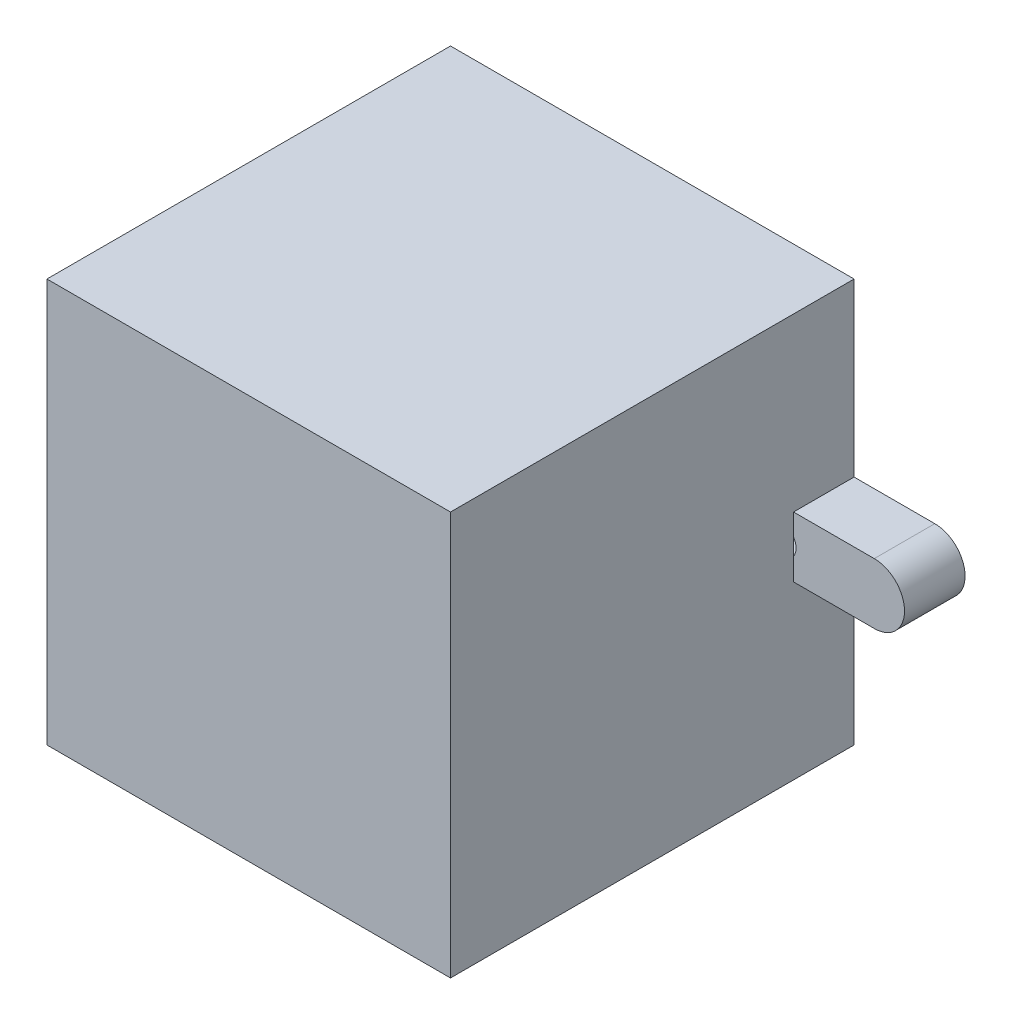
ISO-10303-21;
HEADER;
FILE_DESCRIPTION(('STEP AP214'),'2;1');
FILE_NAME('part.step','',(''),(''),'','','');
FILE_SCHEMA(('AUTOMOTIVE_DESIGN { 1 0 10303 214 1 1 1 1 }'));
ENDSEC;
DATA;
#1=APPLICATION_CONTEXT('core data for automotive mechanical design processes');
#2=APPLICATION_PROTOCOL_DEFINITION('international standard','automotive_design',2000,#1);
#3=PRODUCT_CONTEXT('',#1,'mechanical');
#4=PRODUCT('Part','Part','',(#3));
#5=PRODUCT_RELATED_PRODUCT_CATEGORY('part','',(#4));
#6=PRODUCT_DEFINITION_FORMATION('','',#4);
#7=PRODUCT_DEFINITION_CONTEXT('part definition',#1,'design');
#8=PRODUCT_DEFINITION('design','',#6,#7);
#9=PRODUCT_DEFINITION_SHAPE('','',#8);
#10=(LENGTH_UNIT() NAMED_UNIT(*) SI_UNIT(.MILLI.,.METRE.));
#11=(NAMED_UNIT(*) PLANE_ANGLE_UNIT() SI_UNIT($,.RADIAN.));
#12=(NAMED_UNIT(*) SI_UNIT($,.STERADIAN.) SOLID_ANGLE_UNIT());
#13=UNCERTAINTY_MEASURE_WITH_UNIT(LENGTH_MEASURE(1.E-05),#10,'distance_accuracy_value','');
#14=(GEOMETRIC_REPRESENTATION_CONTEXT(3) GLOBAL_UNCERTAINTY_ASSIGNED_CONTEXT((#13)) GLOBAL_UNIT_ASSIGNED_CONTEXT((#10,
#11,#12)) REPRESENTATION_CONTEXT('',''));
#15=CARTESIAN_POINT('',(0.,0.,0.));
#16=DIRECTION('',(0.,0.,1.));
#17=DIRECTION('',(1.,0.,0.));
#18=AXIS2_PLACEMENT_3D('',#15,#16,#17);
#19=CARTESIAN_POINT('',(-22.,-0.0526670776595875,4.));
#20=DIRECTION('',(0.,0.,-1.));
#21=DIRECTION('',(-1.,0.,0.));
#22=AXIS2_PLACEMENT_3D('',#19,#20,#21);
#23=CYLINDRICAL_SURFACE('',#22,2.);
#24=DIRECTION('',(0.,0.,1.));
#25=VECTOR('',#24,1.);
#26=CARTESIAN_POINT('',(-22.,1.94733292234041,4.));
#27=LINE('',#26,#25);
#28=CARTESIAN_POINT('',(-22.,1.94733292234041,4.));
#29=VERTEX_POINT('',#28);
#30=CARTESIAN_POINT('',(-22.,1.94733292234041,0.));
#31=VERTEX_POINT('',#30);
#32=EDGE_CURVE('E348',#29,#31,#27,.F.);
#33=ORIENTED_EDGE('',*,*,#32,.F.);
#34=CARTESIAN_POINT('',(-22.,-0.0526670776595875,4.));
#35=DIRECTION('',(0.,0.,-1.));
#36=DIRECTION('',(-1.,0.,0.));
#37=AXIS2_PLACEMENT_3D('',#34,#35,#36);
#38=CIRCLE('',#37,2.);
#39=CARTESIAN_POINT('',(-22.,-2.05266707765959,4.));
#40=VERTEX_POINT('',#39);
#41=EDGE_CURVE('E51',#40,#29,#38,.T.);
#42=ORIENTED_EDGE('',*,*,#41,.F.);
#43=DIRECTION('',(0.,0.,1.));
#44=VECTOR('',#43,1.);
#45=CARTESIAN_POINT('',(-22.,-2.05266707765959,4.));
#46=LINE('',#45,#44);
#47=CARTESIAN_POINT('',(-22.,-2.05266707765959,0.));
#48=VERTEX_POINT('',#47);
#49=EDGE_CURVE('E351',#48,#40,#46,.T.);
#50=ORIENTED_EDGE('',*,*,#49,.F.);
#51=CARTESIAN_POINT('',(-22.,-0.0526670776595875,0.));
#52=DIRECTION('',(0.,0.,1.));
#53=DIRECTION('',(1.,0.,0.));
#54=AXIS2_PLACEMENT_3D('',#51,#52,#53);
#55=CIRCLE('',#54,2.);
#56=EDGE_CURVE('E11',#48,#31,#55,.F.);
#57=ORIENTED_EDGE('',*,*,#56,.T.);
#58=EDGE_LOOP('',(#33,#42,#50,#57));
#59=FACE_BOUND('',#58,.T.);
#60=ADVANCED_FACE('F43',(#59),#23,.F.);
#61=CARTESIAN_POINT('',(-28.,0.,0.));
#62=DIRECTION('',(0.,0.,-1.));
#63=DIRECTION('',(-1.,0.,0.));
#64=AXIS2_PLACEMENT_3D('',#61,#62,#63);
#65=CYLINDRICAL_SURFACE('',#64,3.);
#66=DIRECTION('',(0.,0.,-1.));
#67=VECTOR('',#66,1.);
#68=CARTESIAN_POINT('',(-28.,3.,6.00000000000001));
#69=LINE('',#68,#67);
#70=CARTESIAN_POINT('',(-28.,3.,0.));
#71=VERTEX_POINT('',#70);
#72=CARTESIAN_POINT('',(-28.,3.,6.00000000000001));
#73=VERTEX_POINT('',#72);
#74=EDGE_CURVE('E338',#71,#73,#69,.F.);
#75=ORIENTED_EDGE('',*,*,#74,.F.);
#76=CARTESIAN_POINT('',(-28.,0.,0.));
#77=DIRECTION('',(0.,0.,1.));
#78=DIRECTION('',(1.,0.,0.));
#79=AXIS2_PLACEMENT_3D('',#76,#77,#78);
#80=CIRCLE('',#79,3.);
#81=CARTESIAN_POINT('',(-28.,-3.,0.));
#82=VERTEX_POINT('',#81);
#83=EDGE_CURVE('E344',#82,#71,#80,.F.);
#84=ORIENTED_EDGE('',*,*,#83,.F.);
#85=DIRECTION('',(0.,0.,-1.));
#86=VECTOR('',#85,1.);
#87=CARTESIAN_POINT('',(-28.,-3.,6.00000000000001));
#88=LINE('',#87,#86);
#89=CARTESIAN_POINT('',(-28.,-3.,6.00000000000001));
#90=VERTEX_POINT('',#89);
#91=EDGE_CURVE('E341',#90,#82,#88,.T.);
#92=ORIENTED_EDGE('',*,*,#91,.F.);
#93=CARTESIAN_POINT('',(-28.,0.,6.00000000000001));
#94=DIRECTION('',(0.,0.,-1.));
#95=DIRECTION('',(-1.,0.,0.));
#96=AXIS2_PLACEMENT_3D('',#93,#94,#95);
#97=CIRCLE('',#96,3.);
#98=EDGE_CURVE('E346',#73,#90,#97,.F.);
#99=ORIENTED_EDGE('',*,*,#98,.F.);
#100=EDGE_LOOP('',(#75,#84,#92,#99));
#101=FACE_BOUND('',#100,.T.);
#102=ADVANCED_FACE('F468',(#101),#65,.T.);
#103=CARTESIAN_POINT('',(22.,0.0294396054467806,0.));
#104=DIRECTION('',(0.,0.,-1.));
#105=DIRECTION('',(-1.,0.,0.));
#106=AXIS2_PLACEMENT_3D('',#103,#104,#105);
#107=CYLINDRICAL_SURFACE('',#106,2.);
#108=DIRECTION('',(0.,0.,1.));
#109=VECTOR('',#108,1.);
#110=CARTESIAN_POINT('',(22.,2.02943960544678,0.));
#111=LINE('',#110,#109);
#112=CARTESIAN_POINT('',(22.,2.02943960544678,0.));
#113=VERTEX_POINT('',#112);
#114=CARTESIAN_POINT('',(22.,2.02943960544678,4.));
#115=VERTEX_POINT('',#114);
#116=EDGE_CURVE('E328',#113,#115,#111,.T.);
#117=ORIENTED_EDGE('',*,*,#116,.F.);
#118=CARTESIAN_POINT('',(22.,0.0294396054467806,0.));
#119=DIRECTION('',(0.,0.,1.));
#120=DIRECTION('',(1.,0.,0.));
#121=AXIS2_PLACEMENT_3D('',#118,#119,#120);
#122=CIRCLE('',#121,2.);
#123=CARTESIAN_POINT('',(22.,-1.97056039455322,0.));
#124=VERTEX_POINT('',#123);
#125=EDGE_CURVE('E336',#113,#124,#122,.F.);
#126=ORIENTED_EDGE('',*,*,#125,.T.);
#127=DIRECTION('',(0.,0.,1.));
#128=VECTOR('',#127,1.);
#129=CARTESIAN_POINT('',(22.,-1.97056039455322,0.));
#130=LINE('',#129,#128);
#131=CARTESIAN_POINT('',(22.,-1.97056039455322,4.));
#132=VERTEX_POINT('',#131);
#133=EDGE_CURVE('E331',#132,#124,#130,.F.);
#134=ORIENTED_EDGE('',*,*,#133,.F.);
#135=CARTESIAN_POINT('',(22.,0.0294396054467806,4.));
#136=DIRECTION('',(0.,0.,1.));
#137=DIRECTION('',(1.,0.,0.));
#138=AXIS2_PLACEMENT_3D('',#135,#136,#137);
#139=CIRCLE('',#138,2.);
#140=EDGE_CURVE('E334',#115,#132,#139,.F.);
#141=ORIENTED_EDGE('',*,*,#140,.F.);
#142=EDGE_LOOP('',(#117,#126,#134,#141));
#143=FACE_BOUND('',#142,.T.);
#144=ADVANCED_FACE('F473',(#143),#107,.F.);
#145=CARTESIAN_POINT('',(28.,0.,6.00000000000001));
#146=DIRECTION('',(0.,0.,-1.));
#147=DIRECTION('',(-1.,0.,0.));
#148=AXIS2_PLACEMENT_3D('',#145,#146,#147);
#149=CYLINDRICAL_SURFACE('',#148,3.);
#150=DIRECTION('',(0.,0.,-1.));
#151=VECTOR('',#150,1.);
#152=CARTESIAN_POINT('',(28.,3.,6.00000000000001));
#153=LINE('',#152,#151);
#154=CARTESIAN_POINT('',(28.,3.,6.00000000000001));
#155=VERTEX_POINT('',#154);
#156=CARTESIAN_POINT('',(28.,3.,0.));
#157=VERTEX_POINT('',#156);
#158=EDGE_CURVE('E315',#155,#157,#153,.T.);
#159=ORIENTED_EDGE('',*,*,#158,.F.);
#160=CARTESIAN_POINT('',(28.,0.,6.00000000000001));
#161=DIRECTION('',(0.,0.,1.));
#162=DIRECTION('',(1.,0.,0.));
#163=AXIS2_PLACEMENT_3D('',#160,#161,#162);
#164=CIRCLE('',#163,3.);
#165=CARTESIAN_POINT('',(28.,-3.,6.00000000000001));
#166=VERTEX_POINT('',#165);
#167=EDGE_CURVE('E324',#166,#155,#164,.T.);
#168=ORIENTED_EDGE('',*,*,#167,.F.);
#169=DIRECTION('',(0.,0.,-1.));
#170=VECTOR('',#169,1.);
#171=CARTESIAN_POINT('',(28.,-3.,6.00000000000001));
#172=LINE('',#171,#170);
#173=CARTESIAN_POINT('',(28.,-3.,0.));
#174=VERTEX_POINT('',#173);
#175=EDGE_CURVE('E321',#174,#166,#172,.F.);
#176=ORIENTED_EDGE('',*,*,#175,.F.);
#177=CARTESIAN_POINT('',(28.,0.,0.));
#178=DIRECTION('',(0.,0.,1.));
#179=DIRECTION('',(1.,0.,0.));
#180=AXIS2_PLACEMENT_3D('',#177,#178,#179);
#181=CIRCLE('',#180,3.);
#182=EDGE_CURVE('E326',#157,#174,#181,.F.);
#183=ORIENTED_EDGE('',*,*,#182,.F.);
#184=EDGE_LOOP('',(#159,#168,#176,#183));
#185=FACE_BOUND('',#184,.T.);
#186=ADVANCED_FACE('F479',(#185),#149,.T.);
#187=CARTESIAN_POINT('',(20.,0.,40.));
#188=DIRECTION('',(-1.,0.,0.));
#189=DIRECTION('',(0.,0.,1.));
#190=AXIS2_PLACEMENT_3D('',#187,#188,#189);
#191=PLANE('',#190);
#192=DIRECTION('',(0.,0.,-1.));
#193=VECTOR('',#192,1.);
#194=CARTESIAN_POINT('',(20.,-3.,6.00000000000001));
#195=LINE('',#194,#193);
#196=CARTESIAN_POINT('',(20.,-3.,6.00000000000001));
#197=VERTEX_POINT('',#196);
#198=CARTESIAN_POINT('',(20.,-3.,0.));
#199=VERTEX_POINT('',#198);
#200=EDGE_CURVE('E415',#197,#199,#195,.T.);
#201=ORIENTED_EDGE('',*,*,#200,.F.);
#202=DIRECTION('',(0.,1.,0.));
#203=VECTOR('',#202,1.);
#204=CARTESIAN_POINT('',(20.,0.,6.00000000000001));
#205=LINE('',#204,#203);
#206=CARTESIAN_POINT('',(20.,-0.799716592142058,6.00000000000001));
#207=VERTEX_POINT('',#206);
#208=EDGE_CURVE('E398',#197,#207,#205,.T.);
#209=ORIENTED_EDGE('',*,*,#208,.T.);
#210=CARTESIAN_POINT('',(20.,0.85859580303562,6.));
#211=VERTEX_POINT('',#210);
#212=EDGE_CURVE('E402',#207,#211,#205,.T.);
#213=ORIENTED_EDGE('',*,*,#212,.T.);
#214=CARTESIAN_POINT('',(20.,3.,6.00000000000001));
#215=VERTEX_POINT('',#214);
#216=EDGE_CURVE('E403',#211,#215,#205,.T.);
#217=ORIENTED_EDGE('',*,*,#216,.T.);
#218=DIRECTION('',(0.,0.,-1.));
#219=VECTOR('',#218,1.);
#220=CARTESIAN_POINT('',(20.,3.,6.00000000000001));
#221=LINE('',#220,#219);
#222=CARTESIAN_POINT('',(20.,3.,0.));
#223=VERTEX_POINT('',#222);
#224=EDGE_CURVE('E408',#215,#223,#221,.T.);
#225=ORIENTED_EDGE('',*,*,#224,.T.);
#226=DIRECTION('',(0.,1.,0.));
#227=VECTOR('',#226,1.);
#228=CARTESIAN_POINT('',(20.,0.,0.));
#229=LINE('',#228,#227);
#230=CARTESIAN_POINT('',(20.,20.,0.));
#231=VERTEX_POINT('',#230);
#232=EDGE_CURVE('E300',#223,#231,#229,.T.);
#233=ORIENTED_EDGE('',*,*,#232,.T.);
#234=DIRECTION('',(0.,0.,-1.));
#235=VECTOR('',#234,1.);
#236=CARTESIAN_POINT('',(20.,20.,40.));
#237=LINE('',#236,#235);
#238=CARTESIAN_POINT('',(20.,20.,40.));
#239=VERTEX_POINT('',#238);
#240=EDGE_CURVE('E308',#239,#231,#237,.T.);
#241=ORIENTED_EDGE('',*,*,#240,.F.);
#242=DIRECTION('',(0.,1.,0.));
#243=VECTOR('',#242,1.);
#244=CARTESIAN_POINT('',(20.,0.,40.));
#245=LINE('',#244,#243);
#246=CARTESIAN_POINT('',(20.,-20.,40.));
#247=VERTEX_POINT('',#246);
#248=EDGE_CURVE('E289',#247,#239,#245,.T.);
#249=ORIENTED_EDGE('',*,*,#248,.F.);
#250=DIRECTION('',(0.,0.,-1.));
#251=VECTOR('',#250,1.);
#252=CARTESIAN_POINT('',(20.,-20.,40.));
#253=LINE('',#252,#251);
#254=CARTESIAN_POINT('',(20.,-20.,0.));
#255=VERTEX_POINT('',#254);
#256=EDGE_CURVE('E311',#247,#255,#253,.T.);
#257=ORIENTED_EDGE('',*,*,#256,.T.);
#258=EDGE_CURVE('E301',#255,#199,#229,.T.);
#259=ORIENTED_EDGE('',*,*,#258,.T.);
#260=EDGE_LOOP('',(#201,#209,#213,#217,#225,#233,#241,#249,#257,#259));
#261=FACE_BOUND('',#260,.T.);
#262=ADVANCED_FACE('F494',(#261),#191,.F.);
#263=CARTESIAN_POINT('',(-20.,0.,40.));
#264=DIRECTION('',(-1.,0.,0.));
#265=DIRECTION('',(0.,0.,1.));
#266=AXIS2_PLACEMENT_3D('',#263,#264,#265);
#267=PLANE('',#266);
#268=DIRECTION('',(0.,0.,-1.));
#269=VECTOR('',#268,1.);
#270=CARTESIAN_POINT('',(-20.,3.,6.00000000000001));
#271=LINE('',#270,#269);
#272=CARTESIAN_POINT('',(-20.,3.,6.00000000000001));
#273=VERTEX_POINT('',#272);
#274=CARTESIAN_POINT('',(-20.,3.,0.));
#275=VERTEX_POINT('',#274);
#276=EDGE_CURVE('E396',#273,#275,#271,.T.);
#277=ORIENTED_EDGE('',*,*,#276,.F.);
#278=DIRECTION('',(0.,-1.,0.));
#279=VECTOR('',#278,1.);
#280=CARTESIAN_POINT('',(-20.,3.,6.00000000000001));
#281=LINE('',#280,#279);
#282=CARTESIAN_POINT('',(-20.,0.776489119929272,6.00000000000001));
#283=VERTEX_POINT('',#282);
#284=EDGE_CURVE('E238',#273,#283,#281,.T.);
#285=ORIENTED_EDGE('',*,*,#284,.T.);
#286=CARTESIAN_POINT('',(-20.,-0.881823275248448,6.));
#287=VERTEX_POINT('',#286);
#288=EDGE_CURVE('E226',#283,#287,#281,.T.);
#289=ORIENTED_EDGE('',*,*,#288,.T.);
#290=CARTESIAN_POINT('',(-20.,-3.,6.00000000000001));
#291=VERTEX_POINT('',#290);
#292=EDGE_CURVE('E229',#287,#291,#281,.T.);
#293=ORIENTED_EDGE('',*,*,#292,.T.);
#294=DIRECTION('',(0.,0.,-1.));
#295=VECTOR('',#294,1.);
#296=CARTESIAN_POINT('',(-20.,-3.,6.00000000000001));
#297=LINE('',#296,#295);
#298=CARTESIAN_POINT('',(-20.,-3.,0.));
#299=VERTEX_POINT('',#298);
#300=EDGE_CURVE('E420',#291,#299,#297,.T.);
#301=ORIENTED_EDGE('',*,*,#300,.T.);
#302=DIRECTION('',(0.,1.,0.));
#303=VECTOR('',#302,1.);
#304=CARTESIAN_POINT('',(-20.,0.,0.));
#305=LINE('',#304,#303);
#306=CARTESIAN_POINT('',(-20.,-20.,0.));
#307=VERTEX_POINT('',#306);
#308=EDGE_CURVE('E294',#307,#299,#305,.T.);
#309=ORIENTED_EDGE('',*,*,#308,.F.);
#310=DIRECTION('',(0.,0.,-1.));
#311=VECTOR('',#310,1.);
#312=CARTESIAN_POINT('',(-20.,-20.,40.));
#313=LINE('',#312,#311);
#314=CARTESIAN_POINT('',(-20.,-20.,40.));
#315=VERTEX_POINT('',#314);
#316=EDGE_CURVE('E313',#315,#307,#313,.T.);
#317=ORIENTED_EDGE('',*,*,#316,.F.);
#318=DIRECTION('',(0.,1.,0.));
#319=VECTOR('',#318,1.);
#320=CARTESIAN_POINT('',(-20.,0.,40.));
#321=LINE('',#320,#319);
#322=CARTESIAN_POINT('',(-20.,20.,40.));
#323=VERTEX_POINT('',#322);
#324=EDGE_CURVE('E282',#315,#323,#321,.T.);
#325=ORIENTED_EDGE('',*,*,#324,.T.);
#326=DIRECTION('',(0.,0.,-1.));
#327=VECTOR('',#326,1.);
#328=CARTESIAN_POINT('',(-20.,20.,40.));
#329=LINE('',#328,#327);
#330=CARTESIAN_POINT('',(-20.,20.,0.));
#331=VERTEX_POINT('',#330);
#332=EDGE_CURVE('E293',#323,#331,#329,.T.);
#333=ORIENTED_EDGE('',*,*,#332,.T.);
#334=EDGE_CURVE('E274',#275,#331,#305,.T.);
#335=ORIENTED_EDGE('',*,*,#334,.F.);
#336=EDGE_LOOP('',(#277,#285,#289,#293,#301,#309,#317,#325,#333,#335));
#337=FACE_BOUND('',#336,.T.);
#338=ADVANCED_FACE('F240',(#337),#267,.T.);
#339=CARTESIAN_POINT('',(0.,-20.,40.));
#340=DIRECTION('',(0.,-1.,0.));
#341=DIRECTION('',(1.,0.,0.));
#342=AXIS2_PLACEMENT_3D('',#339,#340,#341);
#343=PLANE('',#342);
#344=DIRECTION('',(-1.,0.,0.));
#345=VECTOR('',#344,1.);
#346=CARTESIAN_POINT('',(0.,-20.,0.));
#347=LINE('',#346,#345);
#348=EDGE_CURVE('E297',#255,#307,#347,.T.);
#349=ORIENTED_EDGE('',*,*,#348,.F.);
#350=ORIENTED_EDGE('',*,*,#256,.F.);
#351=DIRECTION('',(-1.,0.,0.));
#352=VECTOR('',#351,1.);
#353=CARTESIAN_POINT('',(0.,-20.,40.));
#354=LINE('',#353,#352);
#355=EDGE_CURVE('E285',#247,#315,#354,.T.);
#356=ORIENTED_EDGE('',*,*,#355,.T.);
#357=ORIENTED_EDGE('',*,*,#316,.T.);
#358=EDGE_LOOP('',(#349,#350,#356,#357));
#359=FACE_BOUND('',#358,.T.);
#360=ADVANCED_FACE('F437',(#359),#343,.T.);
#361=CARTESIAN_POINT('',(0.,20.,40.));
#362=DIRECTION('',(0.,-1.,0.));
#363=DIRECTION('',(1.,0.,0.));
#364=AXIS2_PLACEMENT_3D('',#361,#362,#363);
#365=PLANE('',#364);
#366=DIRECTION('',(-1.,0.,0.));
#367=VECTOR('',#366,1.);
#368=CARTESIAN_POINT('',(0.,20.,0.));
#369=LINE('',#368,#367);
#370=EDGE_CURVE('E286',#231,#331,#369,.T.);
#371=ORIENTED_EDGE('',*,*,#370,.T.);
#372=ORIENTED_EDGE('',*,*,#332,.F.);
#373=DIRECTION('',(-1.,0.,0.));
#374=VECTOR('',#373,1.);
#375=CARTESIAN_POINT('',(0.,20.,40.));
#376=LINE('',#375,#374);
#377=EDGE_CURVE('E291',#239,#323,#376,.T.);
#378=ORIENTED_EDGE('',*,*,#377,.F.);
#379=ORIENTED_EDGE('',*,*,#240,.T.);
#380=EDGE_LOOP('',(#371,#372,#378,#379));
#381=FACE_BOUND('',#380,.T.);
#382=ADVANCED_FACE('F447',(#381),#365,.F.);
#383=CARTESIAN_POINT('',(0.,0.,40.));
#384=DIRECTION('',(0.,0.,1.));
#385=DIRECTION('',(1.,0.,0.));
#386=AXIS2_PLACEMENT_3D('',#383,#384,#385);
#387=PLANE('',#386);
#388=ORIENTED_EDGE('',*,*,#324,.F.);
#389=ORIENTED_EDGE('',*,*,#355,.F.);
#390=ORIENTED_EDGE('',*,*,#248,.T.);
#391=ORIENTED_EDGE('',*,*,#377,.T.);
#392=EDGE_LOOP('',(#388,#389,#390,#391));
#393=FACE_BOUND('',#392,.T.);
#394=ADVANCED_FACE('F442',(#393),#387,.T.);
#395=CARTESIAN_POINT('',(0.,0.,0.));
#396=DIRECTION('',(0.,0.,1.));
#397=DIRECTION('',(1.,0.,0.));
#398=AXIS2_PLACEMENT_3D('',#395,#396,#397);
#399=PLANE('',#398);
#400=DIRECTION('',(0.,1.,0.));
#401=VECTOR('',#400,1.);
#402=CARTESIAN_POINT('',(-13.5,-13.5,0.));
#403=LINE('',#402,#401);
#404=CARTESIAN_POINT('',(-13.5,1.94733292234041,0.));
#405=VERTEX_POINT('',#404);
#406=CARTESIAN_POINT('',(-13.5,13.5,0.));
#407=VERTEX_POINT('',#406);
#408=EDGE_CURVE('E266',#405,#407,#403,.T.);
#409=ORIENTED_EDGE('',*,*,#408,.F.);
#410=DIRECTION('',(1.,0.,0.));
#411=VECTOR('',#410,1.);
#412=CARTESIAN_POINT('',(-13.5,1.94733292234041,0.));
#413=LINE('',#412,#411);
#414=EDGE_CURVE('E375',#31,#405,#413,.T.);
#415=ORIENTED_EDGE('',*,*,#414,.F.);
#416=ORIENTED_EDGE('',*,*,#56,.F.);
#417=DIRECTION('',(-1.,0.,0.));
#418=VECTOR('',#417,1.);
#419=CARTESIAN_POINT('',(-13.5,-2.05266707765959,0.));
#420=LINE('',#419,#418);
#421=CARTESIAN_POINT('',(-13.5,-2.05266707765959,0.));
#422=VERTEX_POINT('',#421);
#423=EDGE_CURVE('E372',#422,#48,#420,.T.);
#424=ORIENTED_EDGE('',*,*,#423,.F.);
#425=CARTESIAN_POINT('',(-13.5,-13.5,0.));
#426=VERTEX_POINT('',#425);
#427=EDGE_CURVE('E267',#426,#422,#403,.T.);
#428=ORIENTED_EDGE('',*,*,#427,.F.);
#429=DIRECTION('',(-1.,0.,0.));
#430=VECTOR('',#429,1.);
#431=CARTESIAN_POINT('',(-13.5,-13.5,0.));
#432=LINE('',#431,#430);
#433=CARTESIAN_POINT('',(13.5,-13.5,0.));
#434=VERTEX_POINT('',#433);
#435=EDGE_CURVE('E262',#434,#426,#432,.T.);
#436=ORIENTED_EDGE('',*,*,#435,.F.);
#437=DIRECTION('',(0.,-1.,0.));
#438=VECTOR('',#437,1.);
#439=CARTESIAN_POINT('',(13.5,-13.5,0.));
#440=LINE('',#439,#438);
#441=CARTESIAN_POINT('',(13.5,-1.97056039455322,0.));
#442=VERTEX_POINT('',#441);
#443=EDGE_CURVE('E263',#442,#434,#440,.T.);
#444=ORIENTED_EDGE('',*,*,#443,.F.);
#445=DIRECTION('',(-1.,0.,0.));
#446=VECTOR('',#445,1.);
#447=CARTESIAN_POINT('',(13.5,-1.97056039455322,0.));
#448=LINE('',#447,#446);
#449=EDGE_CURVE('E384',#124,#442,#448,.T.);
#450=ORIENTED_EDGE('',*,*,#449,.F.);
#451=ORIENTED_EDGE('',*,*,#125,.F.);
#452=DIRECTION('',(1.,0.,0.));
#453=VECTOR('',#452,1.);
#454=CARTESIAN_POINT('',(13.5,2.02943960544678,0.));
#455=LINE('',#454,#453);
#456=CARTESIAN_POINT('',(13.5,2.02943960544678,0.));
#457=VERTEX_POINT('',#456);
#458=EDGE_CURVE('E378',#457,#113,#455,.T.);
#459=ORIENTED_EDGE('',*,*,#458,.F.);
#460=CARTESIAN_POINT('',(13.5,13.5,0.));
#461=VERTEX_POINT('',#460);
#462=EDGE_CURVE('E259',#461,#457,#440,.T.);
#463=ORIENTED_EDGE('',*,*,#462,.F.);
#464=DIRECTION('',(1.,0.,0.));
#465=VECTOR('',#464,1.);
#466=CARTESIAN_POINT('',(-13.5,13.5,0.));
#467=LINE('',#466,#465);
#468=EDGE_CURVE('E249',#407,#461,#467,.T.);
#469=ORIENTED_EDGE('',*,*,#468,.F.);
#470=EDGE_LOOP('',(#409,#415,#416,#424,#428,#436,#444,#450,#451,#459,#463,#469));
#471=FACE_BOUND('',#470,.T.);
#472=DIRECTION('',(-1.,0.,0.));
#473=VECTOR('',#472,1.);
#474=CARTESIAN_POINT('',(-20.,-3.,0.));
#475=LINE('',#474,#473);
#476=EDGE_CURVE('E413',#299,#82,#475,.T.);
#477=ORIENTED_EDGE('',*,*,#476,.T.);
#478=ORIENTED_EDGE('',*,*,#83,.T.);
#479=DIRECTION('',(1.,0.,0.));
#480=VECTOR('',#479,1.);
#481=CARTESIAN_POINT('',(-20.,3.,0.));
#482=LINE('',#481,#480);
#483=EDGE_CURVE('E241',#71,#275,#482,.T.);
#484=ORIENTED_EDGE('',*,*,#483,.T.);
#485=ORIENTED_EDGE('',*,*,#334,.T.);
#486=ORIENTED_EDGE('',*,*,#370,.F.);
#487=ORIENTED_EDGE('',*,*,#232,.F.);
#488=DIRECTION('',(1.,0.,0.));
#489=VECTOR('',#488,1.);
#490=CARTESIAN_POINT('',(20.,3.,0.));
#491=LINE('',#490,#489);
#492=EDGE_CURVE('E409',#223,#157,#491,.T.);
#493=ORIENTED_EDGE('',*,*,#492,.T.);
#494=ORIENTED_EDGE('',*,*,#182,.T.);
#495=DIRECTION('',(-1.,0.,0.));
#496=VECTOR('',#495,1.);
#497=CARTESIAN_POINT('',(20.,-3.,0.));
#498=LINE('',#497,#496);
#499=EDGE_CURVE('E412',#174,#199,#498,.T.);
#500=ORIENTED_EDGE('',*,*,#499,.T.);
#501=ORIENTED_EDGE('',*,*,#258,.F.);
#502=ORIENTED_EDGE('',*,*,#348,.T.);
#503=ORIENTED_EDGE('',*,*,#308,.T.);
#504=EDGE_LOOP('',(#477,#478,#484,#485,#486,#487,#493,#494,#500,#501,#502,#503));
#505=FACE_BOUND('',#504,.T.);
#506=ADVANCED_FACE('F433',(#471,#505),#399,.F.);
#507=CARTESIAN_POINT('',(13.5,-13.5,39.));
#508=DIRECTION('',(1.,0.,0.));
#509=DIRECTION('',(0.,0.,-1.));
#510=AXIS2_PLACEMENT_3D('',#507,#508,#509);
#511=PLANE('',#510);
#512=DIRECTION('',(0.,1.,0.));
#513=VECTOR('',#512,1.);
#514=CARTESIAN_POINT('',(13.5,2.02943960544678,4.));
#515=LINE('',#514,#513);
#516=CARTESIAN_POINT('',(13.5,-1.97056039455322,4.));
#517=VERTEX_POINT('',#516);
#518=CARTESIAN_POINT('',(13.5,2.02943960544678,4.));
#519=VERTEX_POINT('',#518);
#520=EDGE_CURVE('E380',#517,#519,#515,.T.);
#521=ORIENTED_EDGE('',*,*,#520,.F.);
#522=DIRECTION('',(0.,0.,-1.));
#523=VECTOR('',#522,1.);
#524=CARTESIAN_POINT('',(13.5,-1.97056039455322,4.));
#525=LINE('',#524,#523);
#526=EDGE_CURVE('E393',#517,#442,#525,.T.);
#527=ORIENTED_EDGE('',*,*,#526,.T.);
#528=ORIENTED_EDGE('',*,*,#443,.T.);
#529=DIRECTION('',(0.,0.,-1.));
#530=VECTOR('',#529,1.);
#531=CARTESIAN_POINT('',(13.5,-13.5,39.));
#532=LINE('',#531,#530);
#533=CARTESIAN_POINT('',(13.5,-13.5,39.));
#534=VERTEX_POINT('',#533);
#535=EDGE_CURVE('E258',#534,#434,#532,.T.);
#536=ORIENTED_EDGE('',*,*,#535,.F.);
#537=DIRECTION('',(0.,-1.,0.));
#538=VECTOR('',#537,1.);
#539=CARTESIAN_POINT('',(13.5,-13.5,39.));
#540=LINE('',#539,#538);
#541=CARTESIAN_POINT('',(13.5,13.5,39.));
#542=VERTEX_POINT('',#541);
#543=EDGE_CURVE('E245',#542,#534,#540,.T.);
#544=ORIENTED_EDGE('',*,*,#543,.F.);
#545=DIRECTION('',(0.,0.,-1.));
#546=VECTOR('',#545,1.);
#547=CARTESIAN_POINT('',(13.5,13.5,39.));
#548=LINE('',#547,#546);
#549=EDGE_CURVE('E272',#542,#461,#548,.T.);
#550=ORIENTED_EDGE('',*,*,#549,.T.);
#551=ORIENTED_EDGE('',*,*,#462,.T.);
#552=DIRECTION('',(0.,0.,-1.));
#553=VECTOR('',#552,1.);
#554=CARTESIAN_POINT('',(13.5,2.02943960544678,4.));
#555=LINE('',#554,#553);
#556=EDGE_CURVE('E389',#519,#457,#555,.T.);
#557=ORIENTED_EDGE('',*,*,#556,.F.);
#558=EDGE_LOOP('',(#521,#527,#528,#536,#544,#550,#551,#557));
#559=FACE_BOUND('',#558,.T.);
#560=ADVANCED_FACE('F506',(#559),#511,.F.);
#561=CARTESIAN_POINT('',(-13.5,13.5,39.));
#562=DIRECTION('',(0.,1.,0.));
#563=DIRECTION('',(-1.,0.,0.));
#564=AXIS2_PLACEMENT_3D('',#561,#562,#563);
#565=PLANE('',#564);
#566=ORIENTED_EDGE('',*,*,#468,.T.);
#567=ORIENTED_EDGE('',*,*,#549,.F.);
#568=DIRECTION('',(1.,0.,0.));
#569=VECTOR('',#568,1.);
#570=CARTESIAN_POINT('',(-13.5,13.5,39.));
#571=LINE('',#570,#569);
#572=CARTESIAN_POINT('',(-13.5,13.5,39.));
#573=VERTEX_POINT('',#572);
#574=EDGE_CURVE('E255',#573,#542,#571,.T.);
#575=ORIENTED_EDGE('',*,*,#574,.F.);
#576=DIRECTION('',(0.,0.,-1.));
#577=VECTOR('',#576,1.);
#578=CARTESIAN_POINT('',(-13.5,13.5,39.));
#579=LINE('',#578,#577);
#580=EDGE_CURVE('E275',#573,#407,#579,.T.);
#581=ORIENTED_EDGE('',*,*,#580,.T.);
#582=EDGE_LOOP('',(#566,#567,#575,#581));
#583=FACE_BOUND('',#582,.T.);
#584=ADVANCED_FACE('F511',(#583),#565,.F.);
#585=CARTESIAN_POINT('',(-13.5,-13.5,39.));
#586=DIRECTION('',(-1.,0.,0.));
#587=DIRECTION('',(0.,0.,1.));
#588=AXIS2_PLACEMENT_3D('',#585,#586,#587);
#589=PLANE('',#588);
#590=DIRECTION('',(0.,-1.,0.));
#591=VECTOR('',#590,1.);
#592=CARTESIAN_POINT('',(-13.5,1.94733292234041,4.));
#593=LINE('',#592,#591);
#594=CARTESIAN_POINT('',(-13.5,1.94733292234041,4.));
#595=VERTEX_POINT('',#594);
#596=CARTESIAN_POINT('',(-13.5,-2.05266707765959,4.));
#597=VERTEX_POINT('',#596);
#598=EDGE_CURVE('E368',#595,#597,#593,.T.);
#599=ORIENTED_EDGE('',*,*,#598,.F.);
#600=DIRECTION('',(0.,0.,-1.));
#601=VECTOR('',#600,1.);
#602=CARTESIAN_POINT('',(-13.5,1.94733292234041,4.));
#603=LINE('',#602,#601);
#604=EDGE_CURVE('E363',#595,#405,#603,.T.);
#605=ORIENTED_EDGE('',*,*,#604,.T.);
#606=ORIENTED_EDGE('',*,*,#408,.T.);
#607=ORIENTED_EDGE('',*,*,#580,.F.);
#608=DIRECTION('',(0.,1.,0.));
#609=VECTOR('',#608,1.);
#610=CARTESIAN_POINT('',(-13.5,-13.5,39.));
#611=LINE('',#610,#609);
#612=CARTESIAN_POINT('',(-13.5,-13.5,39.));
#613=VERTEX_POINT('',#612);
#614=EDGE_CURVE('E252',#613,#573,#611,.T.);
#615=ORIENTED_EDGE('',*,*,#614,.F.);
#616=DIRECTION('',(0.,0.,-1.));
#617=VECTOR('',#616,1.);
#618=CARTESIAN_POINT('',(-13.5,-13.5,39.));
#619=LINE('',#618,#617);
#620=EDGE_CURVE('E278',#613,#426,#619,.T.);
#621=ORIENTED_EDGE('',*,*,#620,.T.);
#622=ORIENTED_EDGE('',*,*,#427,.T.);
#623=DIRECTION('',(0.,0.,-1.));
#624=VECTOR('',#623,1.);
#625=CARTESIAN_POINT('',(-13.5,-2.05266707765959,4.));
#626=LINE('',#625,#624);
#627=EDGE_CURVE('E365',#597,#422,#626,.T.);
#628=ORIENTED_EDGE('',*,*,#627,.F.);
#629=EDGE_LOOP('',(#599,#605,#606,#607,#615,#621,#622,#628));
#630=FACE_BOUND('',#629,.T.);
#631=ADVANCED_FACE('F517',(#630),#589,.F.);
#632=CARTESIAN_POINT('',(-13.5,-13.5,39.));
#633=DIRECTION('',(0.,-1.,0.));
#634=DIRECTION('',(1.,0.,0.));
#635=AXIS2_PLACEMENT_3D('',#632,#633,#634);
#636=PLANE('',#635);
#637=ORIENTED_EDGE('',*,*,#435,.T.);
#638=ORIENTED_EDGE('',*,*,#620,.F.);
#639=DIRECTION('',(-1.,0.,0.));
#640=VECTOR('',#639,1.);
#641=CARTESIAN_POINT('',(-13.5,-13.5,39.));
#642=LINE('',#641,#640);
#643=EDGE_CURVE('E248',#534,#613,#642,.T.);
#644=ORIENTED_EDGE('',*,*,#643,.F.);
#645=ORIENTED_EDGE('',*,*,#535,.T.);
#646=EDGE_LOOP('',(#637,#638,#644,#645));
#647=FACE_BOUND('',#646,.T.);
#648=ADVANCED_FACE('F513',(#647),#636,.F.);
#649=CARTESIAN_POINT('',(0.,0.,39.));
#650=DIRECTION('',(0.,0.,-1.));
#651=DIRECTION('',(-1.,0.,0.));
#652=AXIS2_PLACEMENT_3D('',#649,#650,#651);
#653=PLANE('',#652);
#654=ORIENTED_EDGE('',*,*,#543,.T.);
#655=ORIENTED_EDGE('',*,*,#643,.T.);
#656=ORIENTED_EDGE('',*,*,#614,.T.);
#657=ORIENTED_EDGE('',*,*,#574,.T.);
#658=EDGE_LOOP('',(#654,#655,#656,#657));
#659=FACE_BOUND('',#658,.T.);
#660=ADVANCED_FACE('F516',(#659),#653,.T.);
#661=CARTESIAN_POINT('',(20.,-3.,6.00000000000001));
#662=DIRECTION('',(0.,-1.,0.));
#663=DIRECTION('',(1.,0.,0.));
#664=AXIS2_PLACEMENT_3D('',#661,#662,#663);
#665=PLANE('',#664);
#666=ORIENTED_EDGE('',*,*,#499,.F.);
#667=ORIENTED_EDGE('',*,*,#175,.T.);
#668=DIRECTION('',(-1.,0.,0.));
#669=VECTOR('',#668,1.);
#670=CARTESIAN_POINT('',(20.,-3.,6.00000000000001));
#671=LINE('',#670,#669);
#672=EDGE_CURVE('E406',#166,#197,#671,.T.);
#673=ORIENTED_EDGE('',*,*,#672,.T.);
#674=ORIENTED_EDGE('',*,*,#200,.T.);
#675=EDGE_LOOP('',(#666,#667,#673,#674));
#676=FACE_BOUND('',#675,.T.);
#677=ADVANCED_FACE('F526',(#676),#665,.T.);
#678=CARTESIAN_POINT('',(20.,3.,6.00000000000001));
#679=DIRECTION('',(0.,1.,0.));
#680=DIRECTION('',(-1.,0.,0.));
#681=AXIS2_PLACEMENT_3D('',#678,#679,#680);
#682=PLANE('',#681);
#683=DIRECTION('',(1.,0.,0.));
#684=VECTOR('',#683,1.);
#685=CARTESIAN_POINT('',(20.,3.,6.00000000000001));
#686=LINE('',#685,#684);
#687=EDGE_CURVE('E401',#215,#155,#686,.T.);
#688=ORIENTED_EDGE('',*,*,#687,.T.);
#689=ORIENTED_EDGE('',*,*,#158,.T.);
#690=ORIENTED_EDGE('',*,*,#492,.F.);
#691=ORIENTED_EDGE('',*,*,#224,.F.);
#692=EDGE_LOOP('',(#688,#689,#690,#691));
#693=FACE_BOUND('',#692,.T.);
#694=ADVANCED_FACE('F463',(#693),#682,.T.);
#695=CARTESIAN_POINT('',(0.,0.,6.00000000000001));
#696=DIRECTION('',(0.,0.,1.));
#697=DIRECTION('',(1.,0.,0.));
#698=AXIS2_PLACEMENT_3D('',#695,#696,#697);
#699=PLANE('',#698);
#700=ORIENTED_EDGE('',*,*,#672,.F.);
#701=ORIENTED_EDGE('',*,*,#167,.T.);
#702=ORIENTED_EDGE('',*,*,#687,.F.);
#703=ORIENTED_EDGE('',*,*,#216,.F.);
#704=CARTESIAN_POINT('',(18.75,0.0294396054467813,6.));
#705=DIRECTION('',(0.,0.,-1.));
#706=DIRECTION('',(-1.,0.,0.));
#707=AXIS2_PLACEMENT_3D('',#704,#705,#706);
#708=CIRCLE('',#707,1.5);
#709=EDGE_CURVE('E376',#211,#207,#708,.T.);
#710=ORIENTED_EDGE('',*,*,#709,.T.);
#711=ORIENTED_EDGE('',*,*,#208,.F.);
#712=EDGE_LOOP('',(#700,#701,#702,#703,#710,#711));
#713=FACE_BOUND('',#712,.T.);
#714=ADVANCED_FACE('F455',(#713),#699,.T.);
#715=CARTESIAN_POINT('',(-20.,3.,6.00000000000001));
#716=DIRECTION('',(0.,1.,0.));
#717=DIRECTION('',(-1.,0.,0.));
#718=AXIS2_PLACEMENT_3D('',#715,#716,#717);
#719=PLANE('',#718);
#720=ORIENTED_EDGE('',*,*,#483,.F.);
#721=ORIENTED_EDGE('',*,*,#74,.T.);
#722=DIRECTION('',(1.,0.,0.));
#723=VECTOR('',#722,1.);
#724=CARTESIAN_POINT('',(-20.,3.,6.00000000000001));
#725=LINE('',#724,#723);
#726=EDGE_CURVE('E422',#73,#273,#725,.T.);
#727=ORIENTED_EDGE('',*,*,#726,.T.);
#728=ORIENTED_EDGE('',*,*,#276,.T.);
#729=EDGE_LOOP('',(#720,#721,#727,#728));
#730=FACE_BOUND('',#729,.T.);
#731=ADVANCED_FACE('F453',(#730),#719,.T.);
#732=CARTESIAN_POINT('',(-20.,-3.,6.00000000000001));
#733=DIRECTION('',(0.,-1.,0.));
#734=DIRECTION('',(0.,0.,-1.));
#735=AXIS2_PLACEMENT_3D('',#732,#733,#734);
#736=PLANE('',#735);
#737=DIRECTION('',(-1.,0.,0.));
#738=VECTOR('',#737,1.);
#739=CARTESIAN_POINT('',(-20.,-3.,6.00000000000001));
#740=LINE('',#739,#738);
#741=EDGE_CURVE('E233',#291,#90,#740,.T.);
#742=ORIENTED_EDGE('',*,*,#741,.T.);
#743=ORIENTED_EDGE('',*,*,#91,.T.);
#744=ORIENTED_EDGE('',*,*,#476,.F.);
#745=ORIENTED_EDGE('',*,*,#300,.F.);
#746=EDGE_LOOP('',(#742,#743,#744,#745));
#747=FACE_BOUND('',#746,.T.);
#748=ADVANCED_FACE('F429',(#747),#736,.T.);
#749=CARTESIAN_POINT('',(0.,0.,6.00000000000001));
#750=DIRECTION('',(0.,0.,-1.));
#751=DIRECTION('',(-1.,0.,0.));
#752=AXIS2_PLACEMENT_3D('',#749,#750,#751);
#753=PLANE('',#752);
#754=ORIENTED_EDGE('',*,*,#726,.F.);
#755=ORIENTED_EDGE('',*,*,#98,.T.);
#756=ORIENTED_EDGE('',*,*,#741,.F.);
#757=ORIENTED_EDGE('',*,*,#292,.F.);
#758=CARTESIAN_POINT('',(-18.75,-0.0526670776595877,6.));
#759=DIRECTION('',(0.,0.,-1.));
#760=DIRECTION('',(-1.,0.,0.));
#761=AXIS2_PLACEMENT_3D('',#758,#759,#760);
#762=CIRCLE('',#761,1.5);
#763=EDGE_CURVE('E213',#287,#283,#762,.T.);
#764=ORIENTED_EDGE('',*,*,#763,.T.);
#765=ORIENTED_EDGE('',*,*,#284,.F.);
#766=EDGE_LOOP('',(#754,#755,#756,#757,#764,#765));
#767=FACE_BOUND('',#766,.T.);
#768=ADVANCED_FACE('F231',(#767),#753,.F.);
#769=CARTESIAN_POINT('',(13.5,-1.97056039455322,4.));
#770=DIRECTION('',(0.,-1.,0.));
#771=DIRECTION('',(1.,0.,0.));
#772=AXIS2_PLACEMENT_3D('',#769,#770,#771);
#773=PLANE('',#772);
#774=DIRECTION('',(-1.,0.,0.));
#775=VECTOR('',#774,1.);
#776=CARTESIAN_POINT('',(13.5,-1.97056039455322,4.));
#777=LINE('',#776,#775);
#778=EDGE_CURVE('E387',#132,#517,#777,.T.);
#779=ORIENTED_EDGE('',*,*,#778,.F.);
#780=ORIENTED_EDGE('',*,*,#133,.T.);
#781=ORIENTED_EDGE('',*,*,#449,.T.);
#782=ORIENTED_EDGE('',*,*,#526,.F.);
#783=EDGE_LOOP('',(#779,#780,#781,#782));
#784=FACE_BOUND('',#783,.T.);
#785=ADVANCED_FACE('F528',(#784),#773,.F.);
#786=CARTESIAN_POINT('',(13.5,2.02943960544678,4.));
#787=DIRECTION('',(0.,1.,0.));
#788=DIRECTION('',(-1.,0.,0.));
#789=AXIS2_PLACEMENT_3D('',#786,#787,#788);
#790=PLANE('',#789);
#791=ORIENTED_EDGE('',*,*,#458,.T.);
#792=ORIENTED_EDGE('',*,*,#116,.T.);
#793=DIRECTION('',(1.,0.,0.));
#794=VECTOR('',#793,1.);
#795=CARTESIAN_POINT('',(13.5,2.02943960544678,4.));
#796=LINE('',#795,#794);
#797=EDGE_CURVE('E383',#519,#115,#796,.T.);
#798=ORIENTED_EDGE('',*,*,#797,.F.);
#799=ORIENTED_EDGE('',*,*,#556,.T.);
#800=EDGE_LOOP('',(#791,#792,#798,#799));
#801=FACE_BOUND('',#800,.T.);
#802=ADVANCED_FACE('F532',(#801),#790,.F.);
#803=CARTESIAN_POINT('',(0.,0.,4.));
#804=DIRECTION('',(0.,0.,1.));
#805=DIRECTION('',(1.,0.,0.));
#806=AXIS2_PLACEMENT_3D('',#803,#804,#805);
#807=PLANE('',#806);
#808=CARTESIAN_POINT('',(18.75,0.0294396054467813,4.));
#809=DIRECTION('',(0.,0.,-1.));
#810=DIRECTION('',(-1.,0.,0.));
#811=AXIS2_PLACEMENT_3D('',#808,#809,#810);
#812=CIRCLE('',#811,1.5);
#813=CARTESIAN_POINT('',(17.25,0.0294396054467813,4.));
#814=VERTEX_POINT('',#813);
#815=EDGE_CURVE('E318',#814,#814,#812,.T.);
#816=ORIENTED_EDGE('',*,*,#815,.F.);
#817=EDGE_LOOP('',(#816));
#818=FACE_BOUND('',#817,.T.);
#819=ORIENTED_EDGE('',*,*,#797,.T.);
#820=ORIENTED_EDGE('',*,*,#140,.T.);
#821=ORIENTED_EDGE('',*,*,#778,.T.);
#822=ORIENTED_EDGE('',*,*,#520,.T.);
#823=EDGE_LOOP('',(#819,#820,#821,#822));
#824=FACE_BOUND('',#823,.T.);
#825=ADVANCED_FACE('F538',(#818,#824),#807,.F.);
#826=CARTESIAN_POINT('',(-13.5,1.94733292234041,4.));
#827=DIRECTION('',(0.,1.,0.));
#828=DIRECTION('',(-1.,0.,0.));
#829=AXIS2_PLACEMENT_3D('',#826,#827,#828);
#830=PLANE('',#829);
#831=DIRECTION('',(1.,0.,0.));
#832=VECTOR('',#831,1.);
#833=CARTESIAN_POINT('',(-13.5,1.94733292234041,4.));
#834=LINE('',#833,#832);
#835=EDGE_CURVE('E357',#29,#595,#834,.T.);
#836=ORIENTED_EDGE('',*,*,#835,.F.);
#837=ORIENTED_EDGE('',*,*,#32,.T.);
#838=ORIENTED_EDGE('',*,*,#414,.T.);
#839=ORIENTED_EDGE('',*,*,#604,.F.);
#840=EDGE_LOOP('',(#836,#837,#838,#839));
#841=FACE_BOUND('',#840,.T.);
#842=ADVANCED_FACE('F361',(#841),#830,.F.);
#843=CARTESIAN_POINT('',(-13.5,-2.05266707765959,4.));
#844=DIRECTION('',(0.,-1.,0.));
#845=DIRECTION('',(0.,0.,-1.));
#846=AXIS2_PLACEMENT_3D('',#843,#844,#845);
#847=PLANE('',#846);
#848=ORIENTED_EDGE('',*,*,#423,.T.);
#849=ORIENTED_EDGE('',*,*,#49,.T.);
#850=DIRECTION('',(-1.,0.,0.));
#851=VECTOR('',#850,1.);
#852=CARTESIAN_POINT('',(-13.5,-2.05266707765959,4.));
#853=LINE('',#852,#851);
#854=EDGE_CURVE('E359',#597,#40,#853,.T.);
#855=ORIENTED_EDGE('',*,*,#854,.F.);
#856=ORIENTED_EDGE('',*,*,#627,.T.);
#857=EDGE_LOOP('',(#848,#849,#855,#856));
#858=FACE_BOUND('',#857,.T.);
#859=ADVANCED_FACE('F575',(#858),#847,.F.);
#860=CARTESIAN_POINT('',(0.,0.,4.));
#861=DIRECTION('',(0.,0.,-1.));
#862=DIRECTION('',(-1.,0.,0.));
#863=AXIS2_PLACEMENT_3D('',#860,#861,#862);
#864=PLANE('',#863);
#865=CARTESIAN_POINT('',(-18.75,-0.0526670776595877,4.));
#866=DIRECTION('',(0.,0.,-1.));
#867=DIRECTION('',(-1.,0.,0.));
#868=AXIS2_PLACEMENT_3D('',#865,#866,#867);
#869=CIRCLE('',#868,1.5);
#870=CARTESIAN_POINT('',(-20.25,-0.0526670776595877,4.));
#871=VERTEX_POINT('',#870);
#872=EDGE_CURVE('E227',#871,#871,#869,.F.);
#873=ORIENTED_EDGE('',*,*,#872,.T.);
#874=EDGE_LOOP('',(#873));
#875=FACE_BOUND('',#874,.T.);
#876=ORIENTED_EDGE('',*,*,#854,.T.);
#877=ORIENTED_EDGE('',*,*,#41,.T.);
#878=ORIENTED_EDGE('',*,*,#835,.T.);
#879=ORIENTED_EDGE('',*,*,#598,.T.);
#880=EDGE_LOOP('',(#876,#877,#878,#879));
#881=FACE_BOUND('',#880,.T.);
#882=ADVANCED_FACE('F354',(#875,#881),#864,.T.);
#883=CARTESIAN_POINT('',(18.75,0.0294396054467813,6.));
#884=DIRECTION('',(0.,0.,-1.));
#885=DIRECTION('',(-1.,0.,0.));
#886=AXIS2_PLACEMENT_3D('',#883,#884,#885);
#887=PLANE('',#886);
#888=ORIENTED_EDGE('',*,*,#212,.F.);
#889=EDGE_CURVE('E566',#207,#211,#708,.T.);
#890=ORIENTED_EDGE('',*,*,#889,.T.);
#891=EDGE_LOOP('',(#888,#890));
#892=FACE_BOUND('',#891,.T.);
#893=ADVANCED_FACE('F565',(#892),#887,.T.);
#894=CARTESIAN_POINT('',(18.75,0.0294396054467813,6.));
#895=DIRECTION('',(0.,0.,-1.));
#896=DIRECTION('',(-1.,0.,0.));
#897=AXIS2_PLACEMENT_3D('',#894,#895,#896);
#898=CYLINDRICAL_SURFACE('',#897,1.5);
#899=ORIENTED_EDGE('',*,*,#709,.F.);
#900=ORIENTED_EDGE('',*,*,#889,.F.);
#901=EDGE_LOOP('',(#899,#900));
#902=FACE_BOUND('',#901,.T.);
#903=ORIENTED_EDGE('',*,*,#815,.T.);
#904=EDGE_LOOP('',(#903));
#905=FACE_BOUND('',#904,.T.);
#906=ADVANCED_FACE('F600',(#902,#905),#898,.F.);
#907=CARTESIAN_POINT('',(-18.75,-0.0526670776595877,3.));
#908=DIRECTION('',(0.,0.,1.));
#909=DIRECTION('',(1.,0.,0.));
#910=AXIS2_PLACEMENT_3D('',#907,#908,#909);
#911=CYLINDRICAL_SURFACE('',#910,1.5);
#912=ORIENTED_EDGE('',*,*,#872,.F.);
#913=EDGE_LOOP('',(#912));
#914=FACE_BOUND('',#913,.T.);
#915=EDGE_CURVE('E216',#283,#287,#762,.T.);
#916=ORIENTED_EDGE('',*,*,#915,.F.);
#917=ORIENTED_EDGE('',*,*,#763,.F.);
#918=EDGE_LOOP('',(#916,#917));
#919=FACE_BOUND('',#918,.T.);
#920=ADVANCED_FACE('F215',(#914,#919),#911,.F.);
#921=CARTESIAN_POINT('',(-18.75,-0.0526670776595877,6.));
#922=DIRECTION('',(0.,0.,-1.));
#923=DIRECTION('',(-1.,0.,0.));
#924=AXIS2_PLACEMENT_3D('',#921,#922,#923);
#925=PLANE('',#924);
#926=ORIENTED_EDGE('',*,*,#915,.T.);
#927=ORIENTED_EDGE('',*,*,#288,.F.);
#928=EDGE_LOOP('',(#926,#927));
#929=FACE_BOUND('',#928,.T.);
#930=ADVANCED_FACE('F224',(#929),#925,.T.);
#931=CLOSED_SHELL('',(#60,#102,#144,#186,#262,#338,#360,#382,#394,#506,#560,#584,#631,#648,#660,
#677,#694,#714,#731,#748,#768,#785,#802,#825,#842,#859,#882,#893,#906,#920,#930));
#932=MANIFOLD_SOLID_BREP('B2',#931);
#933=ADVANCED_BREP_SHAPE_REPRESENTATION('',(#18,#932),#14);
#934=SHAPE_DEFINITION_REPRESENTATION(#9,#933);
ENDSEC;
END-ISO-10303-21;
